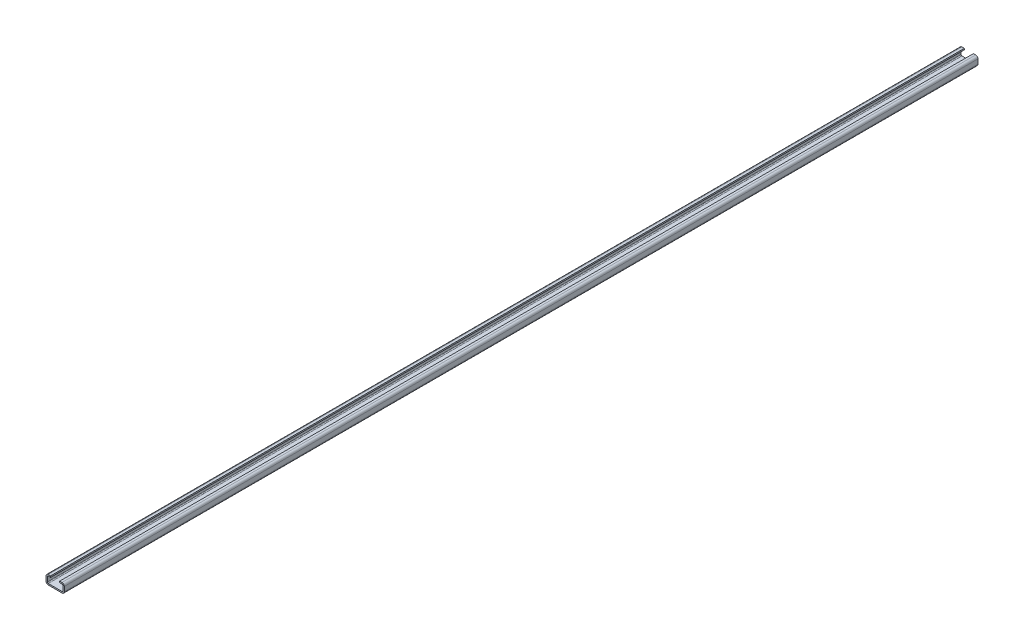
ISO-10303-21;
HEADER;
FILE_DESCRIPTION(('STEP AP214'),'2;1');
FILE_NAME('part.step','',(''),(''),'','','');
FILE_SCHEMA(('AUTOMOTIVE_DESIGN { 1 0 10303 214 1 1 1 1 }'));
ENDSEC;
DATA;
#1=APPLICATION_CONTEXT('core data for automotive mechanical design processes');
#2=APPLICATION_PROTOCOL_DEFINITION('international standard','automotive_design',2000,#1);
#3=PRODUCT_CONTEXT('',#1,'mechanical');
#4=PRODUCT('Part','Part','',(#3));
#5=PRODUCT_RELATED_PRODUCT_CATEGORY('part','',(#4));
#6=PRODUCT_DEFINITION_FORMATION('','',#4);
#7=PRODUCT_DEFINITION_CONTEXT('part definition',#1,'design');
#8=PRODUCT_DEFINITION('design','',#6,#7);
#9=PRODUCT_DEFINITION_SHAPE('','',#8);
#10=(LENGTH_UNIT() NAMED_UNIT(*) SI_UNIT(.MILLI.,.METRE.));
#11=(NAMED_UNIT(*) PLANE_ANGLE_UNIT() SI_UNIT($,.RADIAN.));
#12=(NAMED_UNIT(*) SI_UNIT($,.STERADIAN.) SOLID_ANGLE_UNIT());
#13=UNCERTAINTY_MEASURE_WITH_UNIT(LENGTH_MEASURE(1.E-05),#10,'distance_accuracy_value','');
#14=(GEOMETRIC_REPRESENTATION_CONTEXT(3) GLOBAL_UNCERTAINTY_ASSIGNED_CONTEXT((#13)) GLOBAL_UNIT_ASSIGNED_CONTEXT((#10,
#11,#12)) REPRESENTATION_CONTEXT('',''));
#15=CARTESIAN_POINT('',(0.,0.,0.));
#16=DIRECTION('',(0.,0.,1.));
#17=DIRECTION('',(1.,0.,0.));
#18=AXIS2_PLACEMENT_3D('',#15,#16,#17);
#19=CARTESIAN_POINT('',(10.,17.,2000.));
#20=DIRECTION('',(-1.,0.,0.));
#21=DIRECTION('',(0.,-1.,0.));
#22=AXIS2_PLACEMENT_3D('',#19,#20,#21);
#23=PLANE('',#22);
#24=DIRECTION('',(0.,1.,0.));
#25=VECTOR('',#24,1.);
#26=CARTESIAN_POINT('',(10.,17.,0.));
#27=LINE('',#26,#25);
#28=CARTESIAN_POINT('',(10.,17.,0.));
#29=VERTEX_POINT('',#28);
#30=CARTESIAN_POINT('',(10.,20.,0.));
#31=VERTEX_POINT('',#30);
#32=EDGE_CURVE('E207',#29,#31,#27,.T.);
#33=ORIENTED_EDGE('',*,*,#32,.F.);
#34=DIRECTION('',(0.,0.,-1.));
#35=VECTOR('',#34,1.);
#36=CARTESIAN_POINT('',(10.,17.,2000.));
#37=LINE('',#36,#35);
#38=CARTESIAN_POINT('',(10.,17.,2000.));
#39=VERTEX_POINT('',#38);
#40=EDGE_CURVE('E11',#39,#29,#37,.T.);
#41=ORIENTED_EDGE('',*,*,#40,.F.);
#42=DIRECTION('',(0.,1.,0.));
#43=VECTOR('',#42,1.);
#44=CARTESIAN_POINT('',(10.,17.,2000.));
#45=LINE('',#44,#43);
#46=CARTESIAN_POINT('',(10.,20.,2000.));
#47=VERTEX_POINT('',#46);
#48=EDGE_CURVE('E259',#39,#47,#45,.T.);
#49=ORIENTED_EDGE('',*,*,#48,.T.);
#50=DIRECTION('',(0.,0.,-1.));
#51=VECTOR('',#50,1.);
#52=CARTESIAN_POINT('',(10.,20.,2000.));
#53=LINE('',#52,#51);
#54=EDGE_CURVE('E42',#47,#31,#53,.T.);
#55=ORIENTED_EDGE('',*,*,#54,.T.);
#56=EDGE_LOOP('',(#33,#41,#49,#55));
#57=FACE_BOUND('',#56,.T.);
#58=ADVANCED_FACE('F39',(#57),#23,.T.);
#59=CARTESIAN_POINT('',(15.,17.,2000.));
#60=DIRECTION('',(0.,-1.,0.));
#61=DIRECTION('',(1.,0.,0.));
#62=AXIS2_PLACEMENT_3D('',#59,#60,#61);
#63=PLANE('',#62);
#64=DIRECTION('',(-1.,0.,0.));
#65=VECTOR('',#64,1.);
#66=CARTESIAN_POINT('',(15.,17.,0.));
#67=LINE('',#66,#65);
#68=CARTESIAN_POINT('',(15.,17.,0.));
#69=VERTEX_POINT('',#68);
#70=EDGE_CURVE('E257',#69,#29,#67,.T.);
#71=ORIENTED_EDGE('',*,*,#70,.F.);
#72=DIRECTION('',(0.,0.,-1.));
#73=VECTOR('',#72,1.);
#74=CARTESIAN_POINT('',(15.,17.,2000.));
#75=LINE('',#74,#73);
#76=CARTESIAN_POINT('',(15.,17.,2000.));
#77=VERTEX_POINT('',#76);
#78=EDGE_CURVE('E48',#77,#69,#75,.T.);
#79=ORIENTED_EDGE('',*,*,#78,.F.);
#80=DIRECTION('',(-1.,0.,0.));
#81=VECTOR('',#80,1.);
#82=CARTESIAN_POINT('',(15.,17.,2000.));
#83=LINE('',#82,#81);
#84=EDGE_CURVE('E188',#77,#39,#83,.T.);
#85=ORIENTED_EDGE('',*,*,#84,.T.);
#86=ORIENTED_EDGE('',*,*,#40,.T.);
#87=EDGE_LOOP('',(#71,#79,#85,#86));
#88=FACE_BOUND('',#87,.T.);
#89=ADVANCED_FACE('F301',(#88),#63,.T.);
#90=CARTESIAN_POINT('',(15.,15.,2000.));
#91=DIRECTION('',(0.,0.,-1.));
#92=DIRECTION('',(-1.,0.,0.));
#93=AXIS2_PLACEMENT_3D('',#90,#91,#92);
#94=CYLINDRICAL_SURFACE('',#93,2.);
#95=CARTESIAN_POINT('',(15.,15.,0.));
#96=DIRECTION('',(0.,0.,1.));
#97=DIRECTION('',(1.,0.,0.));
#98=AXIS2_PLACEMENT_3D('',#95,#96,#97);
#99=CIRCLE('',#98,2.);
#100=CARTESIAN_POINT('',(17.,15.,0.));
#101=VERTEX_POINT('',#100);
#102=EDGE_CURVE('E192',#69,#101,#99,.F.);
#103=ORIENTED_EDGE('',*,*,#102,.T.);
#104=DIRECTION('',(0.,0.,-1.));
#105=VECTOR('',#104,1.);
#106=CARTESIAN_POINT('',(17.,15.,2000.));
#107=LINE('',#106,#105);
#108=CARTESIAN_POINT('',(17.,15.,2000.));
#109=VERTEX_POINT('',#108);
#110=EDGE_CURVE('E190',#109,#101,#107,.T.);
#111=ORIENTED_EDGE('',*,*,#110,.F.);
#112=CARTESIAN_POINT('',(15.,15.,2000.));
#113=DIRECTION('',(0.,0.,1.));
#114=DIRECTION('',(1.,0.,0.));
#115=AXIS2_PLACEMENT_3D('',#112,#113,#114);
#116=CIRCLE('',#115,2.);
#117=EDGE_CURVE('E183',#77,#109,#116,.F.);
#118=ORIENTED_EDGE('',*,*,#117,.F.);
#119=ORIENTED_EDGE('',*,*,#78,.T.);
#120=EDGE_LOOP('',(#103,#111,#118,#119));
#121=FACE_BOUND('',#120,.T.);
#122=ADVANCED_FACE('F191',(#121),#94,.F.);
#123=CARTESIAN_POINT('',(17.,5.,2000.));
#124=DIRECTION('',(-1.,0.,0.));
#125=DIRECTION('',(0.,0.,1.));
#126=AXIS2_PLACEMENT_3D('',#123,#124,#125);
#127=PLANE('',#126);
#128=DIRECTION('',(0.,1.,0.));
#129=VECTOR('',#128,1.);
#130=CARTESIAN_POINT('',(17.,5.,0.));
#131=LINE('',#130,#129);
#132=CARTESIAN_POINT('',(17.,5.,0.));
#133=VERTEX_POINT('',#132);
#134=EDGE_CURVE('E254',#133,#101,#131,.T.);
#135=ORIENTED_EDGE('',*,*,#134,.F.);
#136=DIRECTION('',(0.,0.,-1.));
#137=VECTOR('',#136,1.);
#138=CARTESIAN_POINT('',(17.,5.,2000.));
#139=LINE('',#138,#137);
#140=CARTESIAN_POINT('',(17.,5.,2000.));
#141=VERTEX_POINT('',#140);
#142=EDGE_CURVE('E196',#141,#133,#139,.T.);
#143=ORIENTED_EDGE('',*,*,#142,.F.);
#144=DIRECTION('',(0.,1.,0.));
#145=VECTOR('',#144,1.);
#146=CARTESIAN_POINT('',(17.,5.,2000.));
#147=LINE('',#146,#145);
#148=EDGE_CURVE('E187',#141,#109,#147,.T.);
#149=ORIENTED_EDGE('',*,*,#148,.T.);
#150=ORIENTED_EDGE('',*,*,#110,.T.);
#151=EDGE_LOOP('',(#135,#143,#149,#150));
#152=FACE_BOUND('',#151,.T.);
#153=ADVANCED_FACE('F198',(#152),#127,.T.);
#154=CARTESIAN_POINT('',(15.,5.,2000.));
#155=DIRECTION('',(0.,0.,-1.));
#156=DIRECTION('',(-1.,0.,0.));
#157=AXIS2_PLACEMENT_3D('',#154,#155,#156);
#158=CYLINDRICAL_SURFACE('',#157,2.);
#159=CARTESIAN_POINT('',(15.,5.,0.));
#160=DIRECTION('',(0.,0.,1.));
#161=DIRECTION('',(1.,0.,0.));
#162=AXIS2_PLACEMENT_3D('',#159,#160,#161);
#163=CIRCLE('',#162,2.);
#164=CARTESIAN_POINT('',(15.,3.,0.));
#165=VERTEX_POINT('',#164);
#166=EDGE_CURVE('E252',#133,#165,#163,.F.);
#167=ORIENTED_EDGE('',*,*,#166,.T.);
#168=DIRECTION('',(0.,0.,-1.));
#169=VECTOR('',#168,1.);
#170=CARTESIAN_POINT('',(15.,3.,2000.));
#171=LINE('',#170,#169);
#172=CARTESIAN_POINT('',(15.,3.,2000.));
#173=VERTEX_POINT('',#172);
#174=EDGE_CURVE('E263',#173,#165,#171,.T.);
#175=ORIENTED_EDGE('',*,*,#174,.F.);
#176=CARTESIAN_POINT('',(15.,5.,2000.));
#177=DIRECTION('',(0.,0.,1.));
#178=DIRECTION('',(1.,0.,0.));
#179=AXIS2_PLACEMENT_3D('',#176,#177,#178);
#180=CIRCLE('',#179,2.);
#181=EDGE_CURVE('E200',#141,#173,#180,.F.);
#182=ORIENTED_EDGE('',*,*,#181,.F.);
#183=ORIENTED_EDGE('',*,*,#142,.T.);
#184=EDGE_LOOP('',(#167,#175,#182,#183));
#185=FACE_BOUND('',#184,.T.);
#186=ADVANCED_FACE('F314',(#185),#158,.F.);
#187=CARTESIAN_POINT('',(15.,3.,2000.));
#188=DIRECTION('',(0.,-1.,0.));
#189=DIRECTION('',(0.,0.,-1.));
#190=AXIS2_PLACEMENT_3D('',#187,#188,#189);
#191=PLANE('',#190);
#192=DIRECTION('',(1.,0.,0.));
#193=VECTOR('',#192,1.);
#194=CARTESIAN_POINT('',(15.,3.,0.));
#195=LINE('',#194,#193);
#196=CARTESIAN_POINT('',(-15.,3.,0.));
#197=VERTEX_POINT('',#196);
#198=EDGE_CURVE('E249',#165,#197,#195,.F.);
#199=ORIENTED_EDGE('',*,*,#198,.T.);
#200=DIRECTION('',(0.,0.,-1.));
#201=VECTOR('',#200,1.);
#202=CARTESIAN_POINT('',(-15.,3.,2000.));
#203=LINE('',#202,#201);
#204=CARTESIAN_POINT('',(-15.,3.,2000.));
#205=VERTEX_POINT('',#204);
#206=EDGE_CURVE('E266',#205,#197,#203,.T.);
#207=ORIENTED_EDGE('',*,*,#206,.F.);
#208=DIRECTION('',(1.,0.,0.));
#209=VECTOR('',#208,1.);
#210=CARTESIAN_POINT('',(15.,3.,2000.));
#211=LINE('',#210,#209);
#212=EDGE_CURVE('E202',#173,#205,#211,.F.);
#213=ORIENTED_EDGE('',*,*,#212,.F.);
#214=ORIENTED_EDGE('',*,*,#174,.T.);
#215=EDGE_LOOP('',(#199,#207,#213,#214));
#216=FACE_BOUND('',#215,.T.);
#217=ADVANCED_FACE('F317',(#216),#191,.F.);
#218=CARTESIAN_POINT('',(-15.,5.,2000.));
#219=DIRECTION('',(0.,0.,-1.));
#220=DIRECTION('',(-1.,0.,0.));
#221=AXIS2_PLACEMENT_3D('',#218,#219,#220);
#222=CYLINDRICAL_SURFACE('',#221,2.);
#223=CARTESIAN_POINT('',(-15.,5.,0.));
#224=DIRECTION('',(0.,0.,1.));
#225=DIRECTION('',(1.,0.,0.));
#226=AXIS2_PLACEMENT_3D('',#223,#224,#225);
#227=CIRCLE('',#226,2.);
#228=CARTESIAN_POINT('',(-17.,5.,0.));
#229=VERTEX_POINT('',#228);
#230=EDGE_CURVE('E246',#229,#197,#227,.T.);
#231=ORIENTED_EDGE('',*,*,#230,.F.);
#232=DIRECTION('',(0.,0.,-1.));
#233=VECTOR('',#232,1.);
#234=CARTESIAN_POINT('',(-17.,5.,2000.));
#235=LINE('',#234,#233);
#236=CARTESIAN_POINT('',(-17.,5.,2000.));
#237=VERTEX_POINT('',#236);
#238=EDGE_CURVE('E268',#237,#229,#235,.T.);
#239=ORIENTED_EDGE('',*,*,#238,.F.);
#240=CARTESIAN_POINT('',(-15.,5.,2000.));
#241=DIRECTION('',(0.,0.,1.));
#242=DIRECTION('',(1.,0.,0.));
#243=AXIS2_PLACEMENT_3D('',#240,#241,#242);
#244=CIRCLE('',#243,2.);
#245=EDGE_CURVE('E506',#237,#205,#244,.T.);
#246=ORIENTED_EDGE('',*,*,#245,.T.);
#247=ORIENTED_EDGE('',*,*,#206,.T.);
#248=EDGE_LOOP('',(#231,#239,#246,#247));
#249=FACE_BOUND('',#248,.T.);
#250=ADVANCED_FACE('F321',(#249),#222,.F.);
#251=CARTESIAN_POINT('',(-17.,5.,2000.));
#252=DIRECTION('',(-1.,0.,0.));
#253=DIRECTION('',(0.,-1.,0.));
#254=AXIS2_PLACEMENT_3D('',#251,#252,#253);
#255=PLANE('',#254);
#256=DIRECTION('',(0.,1.,0.));
#257=VECTOR('',#256,1.);
#258=CARTESIAN_POINT('',(-17.,5.,0.));
#259=LINE('',#258,#257);
#260=CARTESIAN_POINT('',(-17.,15.,0.));
#261=VERTEX_POINT('',#260);
#262=EDGE_CURVE('E244',#229,#261,#259,.T.);
#263=ORIENTED_EDGE('',*,*,#262,.T.);
#264=DIRECTION('',(0.,0.,-1.));
#265=VECTOR('',#264,1.);
#266=CARTESIAN_POINT('',(-17.,15.,2000.));
#267=LINE('',#266,#265);
#268=CARTESIAN_POINT('',(-17.,15.,2000.));
#269=VERTEX_POINT('',#268);
#270=EDGE_CURVE('E270',#269,#261,#267,.T.);
#271=ORIENTED_EDGE('',*,*,#270,.F.);
#272=DIRECTION('',(0.,1.,0.));
#273=VECTOR('',#272,1.);
#274=CARTESIAN_POINT('',(-17.,5.,2000.));
#275=LINE('',#274,#273);
#276=EDGE_CURVE('E503',#237,#269,#275,.T.);
#277=ORIENTED_EDGE('',*,*,#276,.F.);
#278=ORIENTED_EDGE('',*,*,#238,.T.);
#279=EDGE_LOOP('',(#263,#271,#277,#278));
#280=FACE_BOUND('',#279,.T.);
#281=ADVANCED_FACE('F325',(#280),#255,.F.);
#282=CARTESIAN_POINT('',(-15.,15.,2000.));
#283=DIRECTION('',(0.,0.,-1.));
#284=DIRECTION('',(-1.,0.,0.));
#285=AXIS2_PLACEMENT_3D('',#282,#283,#284);
#286=CYLINDRICAL_SURFACE('',#285,2.);
#287=CARTESIAN_POINT('',(-15.,15.,0.));
#288=DIRECTION('',(0.,0.,1.));
#289=DIRECTION('',(1.,0.,0.));
#290=AXIS2_PLACEMENT_3D('',#287,#288,#289);
#291=CIRCLE('',#290,2.);
#292=CARTESIAN_POINT('',(-15.,17.,0.));
#293=VERTEX_POINT('',#292);
#294=EDGE_CURVE('E242',#261,#293,#291,.F.);
#295=ORIENTED_EDGE('',*,*,#294,.T.);
#296=DIRECTION('',(0.,0.,-1.));
#297=VECTOR('',#296,1.);
#298=CARTESIAN_POINT('',(-15.,17.,2000.));
#299=LINE('',#298,#297);
#300=CARTESIAN_POINT('',(-15.,17.,2000.));
#301=VERTEX_POINT('',#300);
#302=EDGE_CURVE('E273',#301,#293,#299,.T.);
#303=ORIENTED_EDGE('',*,*,#302,.F.);
#304=CARTESIAN_POINT('',(-15.,15.,2000.));
#305=DIRECTION('',(0.,0.,1.));
#306=DIRECTION('',(1.,0.,0.));
#307=AXIS2_PLACEMENT_3D('',#304,#305,#306);
#308=CIRCLE('',#307,2.);
#309=EDGE_CURVE('E501',#269,#301,#308,.F.);
#310=ORIENTED_EDGE('',*,*,#309,.F.);
#311=ORIENTED_EDGE('',*,*,#270,.T.);
#312=EDGE_LOOP('',(#295,#303,#310,#311));
#313=FACE_BOUND('',#312,.T.);
#314=ADVANCED_FACE('F329',(#313),#286,.F.);
#315=CARTESIAN_POINT('',(-15.,17.,2000.));
#316=DIRECTION('',(0.,1.,0.));
#317=DIRECTION('',(-1.,0.,0.));
#318=AXIS2_PLACEMENT_3D('',#315,#316,#317);
#319=PLANE('',#318);
#320=DIRECTION('',(1.,0.,0.));
#321=VECTOR('',#320,1.);
#322=CARTESIAN_POINT('',(-15.,17.,0.));
#323=LINE('',#322,#321);
#324=CARTESIAN_POINT('',(-10.,17.,0.));
#325=VERTEX_POINT('',#324);
#326=EDGE_CURVE('E240',#293,#325,#323,.T.);
#327=ORIENTED_EDGE('',*,*,#326,.T.);
#328=DIRECTION('',(0.,0.,-1.));
#329=VECTOR('',#328,1.);
#330=CARTESIAN_POINT('',(-10.,17.,2000.));
#331=LINE('',#330,#329);
#332=CARTESIAN_POINT('',(-10.,17.,2000.));
#333=VERTEX_POINT('',#332);
#334=EDGE_CURVE('E276',#333,#325,#331,.T.);
#335=ORIENTED_EDGE('',*,*,#334,.F.);
#336=DIRECTION('',(1.,0.,0.));
#337=VECTOR('',#336,1.);
#338=CARTESIAN_POINT('',(-15.,17.,2000.));
#339=LINE('',#338,#337);
#340=EDGE_CURVE('E494',#301,#333,#339,.T.);
#341=ORIENTED_EDGE('',*,*,#340,.F.);
#342=ORIENTED_EDGE('',*,*,#302,.T.);
#343=EDGE_LOOP('',(#327,#335,#341,#342));
#344=FACE_BOUND('',#343,.T.);
#345=ADVANCED_FACE('F333',(#344),#319,.F.);
#346=CARTESIAN_POINT('',(-10.,17.,2000.));
#347=DIRECTION('',(-1.,0.,0.));
#348=DIRECTION('',(0.,-1.,0.));
#349=AXIS2_PLACEMENT_3D('',#346,#347,#348);
#350=PLANE('',#349);
#351=DIRECTION('',(0.,1.,0.));
#352=VECTOR('',#351,1.);
#353=CARTESIAN_POINT('',(-10.,17.,0.));
#354=LINE('',#353,#352);
#355=CARTESIAN_POINT('',(-10.,20.,0.));
#356=VERTEX_POINT('',#355);
#357=EDGE_CURVE('E237',#325,#356,#354,.T.);
#358=ORIENTED_EDGE('',*,*,#357,.T.);
#359=DIRECTION('',(0.,0.,-1.));
#360=VECTOR('',#359,1.);
#361=CARTESIAN_POINT('',(-10.,20.,2000.));
#362=LINE('',#361,#360);
#363=CARTESIAN_POINT('',(-10.,20.,2000.));
#364=VERTEX_POINT('',#363);
#365=EDGE_CURVE('E279',#364,#356,#362,.T.);
#366=ORIENTED_EDGE('',*,*,#365,.F.);
#367=DIRECTION('',(0.,1.,0.));
#368=VECTOR('',#367,1.);
#369=CARTESIAN_POINT('',(-10.,17.,2000.));
#370=LINE('',#369,#368);
#371=EDGE_CURVE('E492',#333,#364,#370,.T.);
#372=ORIENTED_EDGE('',*,*,#371,.F.);
#373=ORIENTED_EDGE('',*,*,#334,.T.);
#374=EDGE_LOOP('',(#358,#366,#372,#373));
#375=FACE_BOUND('',#374,.T.);
#376=ADVANCED_FACE('F337',(#375),#350,.F.);
#377=CARTESIAN_POINT('',(-15.,20.,2000.));
#378=DIRECTION('',(0.,1.,0.));
#379=DIRECTION('',(-1.,0.,0.));
#380=AXIS2_PLACEMENT_3D('',#377,#378,#379);
#381=PLANE('',#380);
#382=DIRECTION('',(1.,0.,0.));
#383=VECTOR('',#382,1.);
#384=CARTESIAN_POINT('',(-15.,20.,0.));
#385=LINE('',#384,#383);
#386=CARTESIAN_POINT('',(-15.,20.,0.));
#387=VERTEX_POINT('',#386);
#388=EDGE_CURVE('E234',#387,#356,#385,.T.);
#389=ORIENTED_EDGE('',*,*,#388,.F.);
#390=DIRECTION('',(0.,0.,-1.));
#391=VECTOR('',#390,1.);
#392=CARTESIAN_POINT('',(-15.,20.,2000.));
#393=LINE('',#392,#391);
#394=CARTESIAN_POINT('',(-15.,20.,2000.));
#395=VERTEX_POINT('',#394);
#396=EDGE_CURVE('E281',#395,#387,#393,.T.);
#397=ORIENTED_EDGE('',*,*,#396,.F.);
#398=DIRECTION('',(1.,0.,0.));
#399=VECTOR('',#398,1.);
#400=CARTESIAN_POINT('',(-15.,20.,2000.));
#401=LINE('',#400,#399);
#402=EDGE_CURVE('E489',#395,#364,#401,.T.);
#403=ORIENTED_EDGE('',*,*,#402,.T.);
#404=ORIENTED_EDGE('',*,*,#365,.T.);
#405=EDGE_LOOP('',(#389,#397,#403,#404));
#406=FACE_BOUND('',#405,.T.);
#407=ADVANCED_FACE('F341',(#406),#381,.T.);
#408=CARTESIAN_POINT('',(-15.,15.,2000.));
#409=DIRECTION('',(0.,0.,-1.));
#410=DIRECTION('',(-1.,0.,0.));
#411=AXIS2_PLACEMENT_3D('',#408,#409,#410);
#412=CYLINDRICAL_SURFACE('',#411,5.);
#413=CARTESIAN_POINT('',(-15.,15.,0.));
#414=DIRECTION('',(0.,0.,-1.));
#415=DIRECTION('',(-1.,0.,0.));
#416=AXIS2_PLACEMENT_3D('',#413,#414,#415);
#417=CIRCLE('',#416,5.);
#418=CARTESIAN_POINT('',(-20.,15.,0.));
#419=VERTEX_POINT('',#418);
#420=EDGE_CURVE('E231',#419,#387,#417,.T.);
#421=ORIENTED_EDGE('',*,*,#420,.F.);
#422=DIRECTION('',(0.,0.,-1.));
#423=VECTOR('',#422,1.);
#424=CARTESIAN_POINT('',(-20.,15.,2000.));
#425=LINE('',#424,#423);
#426=CARTESIAN_POINT('',(-20.,15.,2000.));
#427=VERTEX_POINT('',#426);
#428=EDGE_CURVE('E283',#427,#419,#425,.T.);
#429=ORIENTED_EDGE('',*,*,#428,.F.);
#430=CARTESIAN_POINT('',(-15.,15.,2000.));
#431=DIRECTION('',(0.,0.,-1.));
#432=DIRECTION('',(-1.,0.,0.));
#433=AXIS2_PLACEMENT_3D('',#430,#431,#432);
#434=CIRCLE('',#433,5.);
#435=EDGE_CURVE('E519',#427,#395,#434,.T.);
#436=ORIENTED_EDGE('',*,*,#435,.T.);
#437=ORIENTED_EDGE('',*,*,#396,.T.);
#438=EDGE_LOOP('',(#421,#429,#436,#437));
#439=FACE_BOUND('',#438,.T.);
#440=ADVANCED_FACE('F345',(#439),#412,.T.);
#441=CARTESIAN_POINT('',(-20.,5.,2000.));
#442=DIRECTION('',(-1.,0.,0.));
#443=DIRECTION('',(0.,-1.,0.));
#444=AXIS2_PLACEMENT_3D('',#441,#442,#443);
#445=PLANE('',#444);
#446=DIRECTION('',(0.,1.,0.));
#447=VECTOR('',#446,1.);
#448=CARTESIAN_POINT('',(-20.,5.,0.));
#449=LINE('',#448,#447);
#450=CARTESIAN_POINT('',(-20.,5.,0.));
#451=VERTEX_POINT('',#450);
#452=EDGE_CURVE('E228',#451,#419,#449,.T.);
#453=ORIENTED_EDGE('',*,*,#452,.F.);
#454=DIRECTION('',(0.,0.,-1.));
#455=VECTOR('',#454,1.);
#456=CARTESIAN_POINT('',(-20.,5.,2000.));
#457=LINE('',#456,#455);
#458=CARTESIAN_POINT('',(-20.,5.,2000.));
#459=VERTEX_POINT('',#458);
#460=EDGE_CURVE('E285',#459,#451,#457,.T.);
#461=ORIENTED_EDGE('',*,*,#460,.F.);
#462=DIRECTION('',(0.,1.,0.));
#463=VECTOR('',#462,1.);
#464=CARTESIAN_POINT('',(-20.,5.,2000.));
#465=LINE('',#464,#463);
#466=EDGE_CURVE('E480',#459,#427,#465,.T.);
#467=ORIENTED_EDGE('',*,*,#466,.T.);
#468=ORIENTED_EDGE('',*,*,#428,.T.);
#469=EDGE_LOOP('',(#453,#461,#467,#468));
#470=FACE_BOUND('',#469,.T.);
#471=ADVANCED_FACE('F349',(#470),#445,.T.);
#472=CARTESIAN_POINT('',(-15.,5.,2000.));
#473=DIRECTION('',(0.,0.,-1.));
#474=DIRECTION('',(-1.,0.,0.));
#475=AXIS2_PLACEMENT_3D('',#472,#473,#474);
#476=CYLINDRICAL_SURFACE('',#475,5.);
#477=CARTESIAN_POINT('',(-15.,5.,0.));
#478=DIRECTION('',(0.,0.,1.));
#479=DIRECTION('',(1.,0.,0.));
#480=AXIS2_PLACEMENT_3D('',#477,#478,#479);
#481=CIRCLE('',#480,5.);
#482=CARTESIAN_POINT('',(-15.,0.,0.));
#483=VERTEX_POINT('',#482);
#484=EDGE_CURVE('E225',#451,#483,#481,.T.);
#485=ORIENTED_EDGE('',*,*,#484,.T.);
#486=DIRECTION('',(0.,0.,-1.));
#487=VECTOR('',#486,1.);
#488=CARTESIAN_POINT('',(-15.,0.,2000.));
#489=LINE('',#488,#487);
#490=CARTESIAN_POINT('',(-15.,0.,2000.));
#491=VERTEX_POINT('',#490);
#492=EDGE_CURVE('E287',#491,#483,#489,.T.);
#493=ORIENTED_EDGE('',*,*,#492,.F.);
#494=CARTESIAN_POINT('',(-15.,5.,2000.));
#495=DIRECTION('',(0.,0.,1.));
#496=DIRECTION('',(1.,0.,0.));
#497=AXIS2_PLACEMENT_3D('',#494,#495,#496);
#498=CIRCLE('',#497,5.);
#499=EDGE_CURVE('E522',#459,#491,#498,.T.);
#500=ORIENTED_EDGE('',*,*,#499,.F.);
#501=ORIENTED_EDGE('',*,*,#460,.T.);
#502=EDGE_LOOP('',(#485,#493,#500,#501));
#503=FACE_BOUND('',#502,.T.);
#504=ADVANCED_FACE('F353',(#503),#476,.T.);
#505=CARTESIAN_POINT('',(15.,0.,2000.));
#506=DIRECTION('',(0.,-1.,0.));
#507=DIRECTION('',(0.,0.,-1.));
#508=AXIS2_PLACEMENT_3D('',#505,#506,#507);
#509=PLANE('',#508);
#510=DIRECTION('',(-1.,0.,0.));
#511=VECTOR('',#510,1.);
#512=CARTESIAN_POINT('',(15.,0.,0.));
#513=LINE('',#512,#511);
#514=CARTESIAN_POINT('',(15.,0.,0.));
#515=VERTEX_POINT('',#514);
#516=EDGE_CURVE('E222',#515,#483,#513,.T.);
#517=ORIENTED_EDGE('',*,*,#516,.F.);
#518=DIRECTION('',(0.,0.,-1.));
#519=VECTOR('',#518,1.);
#520=CARTESIAN_POINT('',(15.,0.,2000.));
#521=LINE('',#520,#519);
#522=CARTESIAN_POINT('',(15.,0.,2000.));
#523=VERTEX_POINT('',#522);
#524=EDGE_CURVE('E289',#523,#515,#521,.T.);
#525=ORIENTED_EDGE('',*,*,#524,.F.);
#526=DIRECTION('',(-1.,0.,0.));
#527=VECTOR('',#526,1.);
#528=CARTESIAN_POINT('',(15.,0.,2000.));
#529=LINE('',#528,#527);
#530=EDGE_CURVE('E524',#523,#491,#529,.T.);
#531=ORIENTED_EDGE('',*,*,#530,.T.);
#532=ORIENTED_EDGE('',*,*,#492,.T.);
#533=EDGE_LOOP('',(#517,#525,#531,#532));
#534=FACE_BOUND('',#533,.T.);
#535=ADVANCED_FACE('F357',(#534),#509,.T.);
#536=CARTESIAN_POINT('',(15.,5.,2000.));
#537=DIRECTION('',(0.,0.,-1.));
#538=DIRECTION('',(-1.,0.,0.));
#539=AXIS2_PLACEMENT_3D('',#536,#537,#538);
#540=CYLINDRICAL_SURFACE('',#539,5.);
#541=CARTESIAN_POINT('',(15.,5.,0.));
#542=DIRECTION('',(0.,0.,-1.));
#543=DIRECTION('',(-1.,0.,0.));
#544=AXIS2_PLACEMENT_3D('',#541,#542,#543);
#545=CIRCLE('',#544,5.);
#546=CARTESIAN_POINT('',(20.,5.,0.));
#547=VERTEX_POINT('',#546);
#548=EDGE_CURVE('E219',#547,#515,#545,.T.);
#549=ORIENTED_EDGE('',*,*,#548,.F.);
#550=DIRECTION('',(0.,0.,-1.));
#551=VECTOR('',#550,1.);
#552=CARTESIAN_POINT('',(20.,5.,2000.));
#553=LINE('',#552,#551);
#554=CARTESIAN_POINT('',(20.,5.,2000.));
#555=VERTEX_POINT('',#554);
#556=EDGE_CURVE('E291',#555,#547,#553,.T.);
#557=ORIENTED_EDGE('',*,*,#556,.F.);
#558=CARTESIAN_POINT('',(15.,5.,2000.));
#559=DIRECTION('',(0.,0.,-1.));
#560=DIRECTION('',(-1.,0.,0.));
#561=AXIS2_PLACEMENT_3D('',#558,#559,#560);
#562=CIRCLE('',#561,5.);
#563=EDGE_CURVE('E470',#555,#523,#562,.T.);
#564=ORIENTED_EDGE('',*,*,#563,.T.);
#565=ORIENTED_EDGE('',*,*,#524,.T.);
#566=EDGE_LOOP('',(#549,#557,#564,#565));
#567=FACE_BOUND('',#566,.T.);
#568=ADVANCED_FACE('F361',(#567),#540,.T.);
#569=CARTESIAN_POINT('',(20.,5.,2000.));
#570=DIRECTION('',(-1.,0.,0.));
#571=DIRECTION('',(0.,0.,1.));
#572=AXIS2_PLACEMENT_3D('',#569,#570,#571);
#573=PLANE('',#572);
#574=DIRECTION('',(0.,1.,0.));
#575=VECTOR('',#574,1.);
#576=CARTESIAN_POINT('',(20.,5.,0.));
#577=LINE('',#576,#575);
#578=CARTESIAN_POINT('',(20.,15.,0.));
#579=VERTEX_POINT('',#578);
#580=EDGE_CURVE('E216',#547,#579,#577,.T.);
#581=ORIENTED_EDGE('',*,*,#580,.T.);
#582=DIRECTION('',(0.,0.,-1.));
#583=VECTOR('',#582,1.);
#584=CARTESIAN_POINT('',(20.,15.,2000.));
#585=LINE('',#584,#583);
#586=CARTESIAN_POINT('',(20.,15.,2000.));
#587=VERTEX_POINT('',#586);
#588=EDGE_CURVE('E293',#587,#579,#585,.T.);
#589=ORIENTED_EDGE('',*,*,#588,.F.);
#590=DIRECTION('',(0.,1.,0.));
#591=VECTOR('',#590,1.);
#592=CARTESIAN_POINT('',(20.,5.,2000.));
#593=LINE('',#592,#591);
#594=EDGE_CURVE('E527',#555,#587,#593,.T.);
#595=ORIENTED_EDGE('',*,*,#594,.F.);
#596=ORIENTED_EDGE('',*,*,#556,.T.);
#597=EDGE_LOOP('',(#581,#589,#595,#596));
#598=FACE_BOUND('',#597,.T.);
#599=ADVANCED_FACE('F365',(#598),#573,.F.);
#600=CARTESIAN_POINT('',(15.,15.,2000.));
#601=DIRECTION('',(0.,0.,-1.));
#602=DIRECTION('',(-1.,0.,0.));
#603=AXIS2_PLACEMENT_3D('',#600,#601,#602);
#604=CYLINDRICAL_SURFACE('',#603,5.);
#605=CARTESIAN_POINT('',(15.,15.,0.));
#606=DIRECTION('',(0.,0.,-1.));
#607=DIRECTION('',(-1.,0.,0.));
#608=AXIS2_PLACEMENT_3D('',#605,#606,#607);
#609=CIRCLE('',#608,5.);
#610=CARTESIAN_POINT('',(15.,20.,0.));
#611=VERTEX_POINT('',#610);
#612=EDGE_CURVE('E213',#611,#579,#609,.T.);
#613=ORIENTED_EDGE('',*,*,#612,.F.);
#614=DIRECTION('',(0.,0.,-1.));
#615=VECTOR('',#614,1.);
#616=CARTESIAN_POINT('',(15.,20.,2000.));
#617=LINE('',#616,#615);
#618=CARTESIAN_POINT('',(15.,20.,2000.));
#619=VERTEX_POINT('',#618);
#620=EDGE_CURVE('E294',#619,#611,#617,.T.);
#621=ORIENTED_EDGE('',*,*,#620,.F.);
#622=CARTESIAN_POINT('',(15.,15.,2000.));
#623=DIRECTION('',(0.,0.,-1.));
#624=DIRECTION('',(-1.,0.,0.));
#625=AXIS2_PLACEMENT_3D('',#622,#623,#624);
#626=CIRCLE('',#625,5.);
#627=EDGE_CURVE('E529',#619,#587,#626,.T.);
#628=ORIENTED_EDGE('',*,*,#627,.T.);
#629=ORIENTED_EDGE('',*,*,#588,.T.);
#630=EDGE_LOOP('',(#613,#621,#628,#629));
#631=FACE_BOUND('',#630,.T.);
#632=ADVANCED_FACE('F369',(#631),#604,.T.);
#633=CARTESIAN_POINT('',(15.,20.,2000.));
#634=DIRECTION('',(0.,-1.,0.));
#635=DIRECTION('',(1.,0.,0.));
#636=AXIS2_PLACEMENT_3D('',#633,#634,#635);
#637=PLANE('',#636);
#638=DIRECTION('',(-1.,0.,0.));
#639=VECTOR('',#638,1.);
#640=CARTESIAN_POINT('',(15.,20.,0.));
#641=LINE('',#640,#639);
#642=EDGE_CURVE('E210',#611,#31,#641,.T.);
#643=ORIENTED_EDGE('',*,*,#642,.T.);
#644=ORIENTED_EDGE('',*,*,#54,.F.);
#645=DIRECTION('',(-1.,0.,0.));
#646=VECTOR('',#645,1.);
#647=CARTESIAN_POINT('',(15.,20.,2000.));
#648=LINE('',#647,#646);
#649=EDGE_CURVE('E131',#619,#47,#648,.T.);
#650=ORIENTED_EDGE('',*,*,#649,.F.);
#651=ORIENTED_EDGE('',*,*,#620,.T.);
#652=EDGE_LOOP('',(#643,#644,#650,#651));
#653=FACE_BOUND('',#652,.T.);
#654=ADVANCED_FACE('F297',(#653),#637,.F.);
#655=CARTESIAN_POINT('',(15.,15.,2000.));
#656=DIRECTION('',(0.,0.,-1.));
#657=DIRECTION('',(-1.,0.,0.));
#658=AXIS2_PLACEMENT_3D('',#655,#656,#657);
#659=PLANE('',#658);
#660=ORIENTED_EDGE('',*,*,#48,.F.);
#661=ORIENTED_EDGE('',*,*,#84,.F.);
#662=ORIENTED_EDGE('',*,*,#117,.T.);
#663=ORIENTED_EDGE('',*,*,#148,.F.);
#664=ORIENTED_EDGE('',*,*,#181,.T.);
#665=ORIENTED_EDGE('',*,*,#212,.T.);
#666=ORIENTED_EDGE('',*,*,#245,.F.);
#667=ORIENTED_EDGE('',*,*,#276,.T.);
#668=ORIENTED_EDGE('',*,*,#309,.T.);
#669=ORIENTED_EDGE('',*,*,#340,.T.);
#670=ORIENTED_EDGE('',*,*,#371,.T.);
#671=ORIENTED_EDGE('',*,*,#402,.F.);
#672=ORIENTED_EDGE('',*,*,#435,.F.);
#673=ORIENTED_EDGE('',*,*,#466,.F.);
#674=ORIENTED_EDGE('',*,*,#499,.T.);
#675=ORIENTED_EDGE('',*,*,#530,.F.);
#676=ORIENTED_EDGE('',*,*,#563,.F.);
#677=ORIENTED_EDGE('',*,*,#594,.T.);
#678=ORIENTED_EDGE('',*,*,#627,.F.);
#679=ORIENTED_EDGE('',*,*,#649,.T.);
#680=EDGE_LOOP('',(#660,#661,#662,#663,#664,#665,#666,#667,#668,#669,#670,#671,#672,#673,#674,
#675,#676,#677,#678,#679));
#681=FACE_BOUND('',#680,.T.);
#682=ADVANCED_FACE('F185',(#681),#659,.F.);
#683=CARTESIAN_POINT('',(15.,15.,0.));
#684=DIRECTION('',(0.,0.,-1.));
#685=DIRECTION('',(-1.,0.,0.));
#686=AXIS2_PLACEMENT_3D('',#683,#684,#685);
#687=PLANE('',#686);
#688=ORIENTED_EDGE('',*,*,#32,.T.);
#689=ORIENTED_EDGE('',*,*,#642,.F.);
#690=ORIENTED_EDGE('',*,*,#612,.T.);
#691=ORIENTED_EDGE('',*,*,#580,.F.);
#692=ORIENTED_EDGE('',*,*,#548,.T.);
#693=ORIENTED_EDGE('',*,*,#516,.T.);
#694=ORIENTED_EDGE('',*,*,#484,.F.);
#695=ORIENTED_EDGE('',*,*,#452,.T.);
#696=ORIENTED_EDGE('',*,*,#420,.T.);
#697=ORIENTED_EDGE('',*,*,#388,.T.);
#698=ORIENTED_EDGE('',*,*,#357,.F.);
#699=ORIENTED_EDGE('',*,*,#326,.F.);
#700=ORIENTED_EDGE('',*,*,#294,.F.);
#701=ORIENTED_EDGE('',*,*,#262,.F.);
#702=ORIENTED_EDGE('',*,*,#230,.T.);
#703=ORIENTED_EDGE('',*,*,#198,.F.);
#704=ORIENTED_EDGE('',*,*,#166,.F.);
#705=ORIENTED_EDGE('',*,*,#134,.T.);
#706=ORIENTED_EDGE('',*,*,#102,.F.);
#707=ORIENTED_EDGE('',*,*,#70,.T.);
#708=EDGE_LOOP('',(#688,#689,#690,#691,#692,#693,#694,#695,#696,#697,#698,#699,#700,#701,#702,
#703,#704,#705,#706,#707));
#709=FACE_BOUND('',#708,.T.);
#710=ADVANCED_FACE('F300',(#709),#687,.T.);
#711=CLOSED_SHELL('',(#58,#89,#122,#153,#186,#217,#250,#281,#314,#345,#376,#407,#440,#471,#504,
#535,#568,#599,#632,#654,#682,#710));
#712=MANIFOLD_SOLID_BREP('B2',#711);
#713=ADVANCED_BREP_SHAPE_REPRESENTATION('',(#18,#712),#14);
#714=SHAPE_DEFINITION_REPRESENTATION(#9,#713);
ENDSEC;
END-ISO-10303-21;
